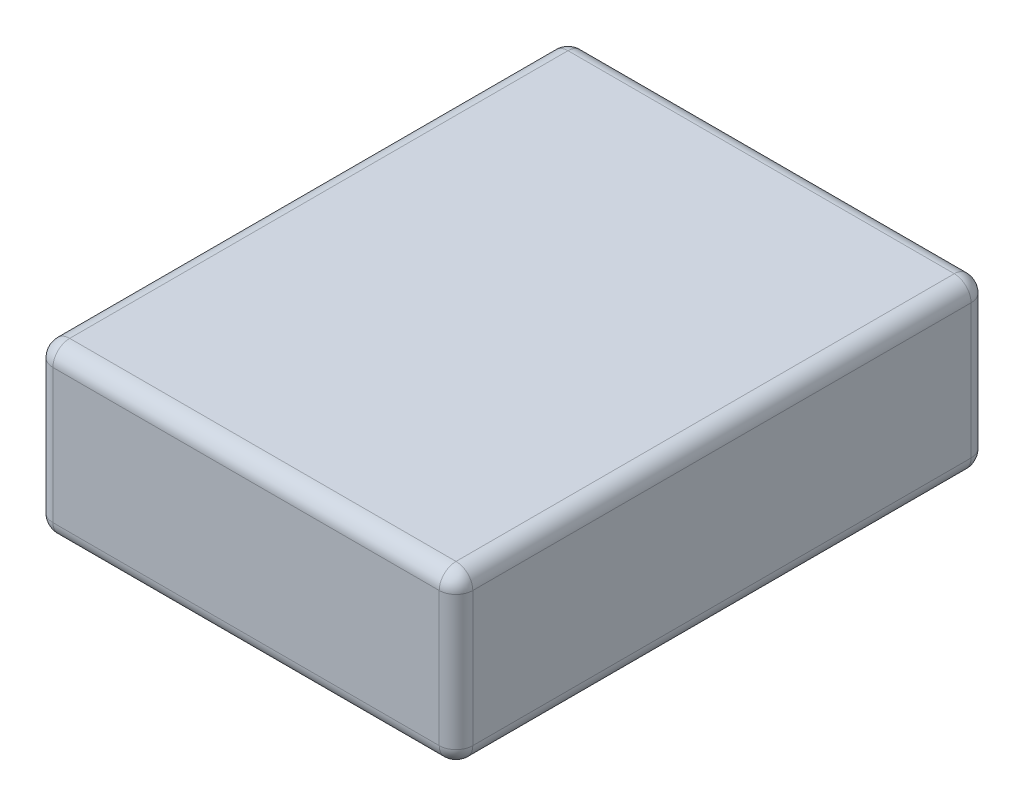
ISO-10303-21;
HEADER;
FILE_DESCRIPTION(('STEP AP214'),'2;1');
FILE_NAME('part.step','',(''),(''),'','','');
FILE_SCHEMA(('AUTOMOTIVE_DESIGN { 1 0 10303 214 1 1 1 1 }'));
ENDSEC;
DATA;
#1=APPLICATION_CONTEXT('core data for automotive mechanical design processes');
#2=APPLICATION_PROTOCOL_DEFINITION('international standard','automotive_design',2000,#1);
#3=PRODUCT_CONTEXT('',#1,'mechanical');
#4=PRODUCT('Part','Part','',(#3));
#5=PRODUCT_RELATED_PRODUCT_CATEGORY('part','',(#4));
#6=PRODUCT_DEFINITION_FORMATION('','',#4);
#7=PRODUCT_DEFINITION_CONTEXT('part definition',#1,'design');
#8=PRODUCT_DEFINITION('design','',#6,#7);
#9=PRODUCT_DEFINITION_SHAPE('','',#8);
#10=(LENGTH_UNIT() NAMED_UNIT(*) SI_UNIT(.MILLI.,.METRE.));
#11=(NAMED_UNIT(*) PLANE_ANGLE_UNIT() SI_UNIT($,.RADIAN.));
#12=(NAMED_UNIT(*) SI_UNIT($,.STERADIAN.) SOLID_ANGLE_UNIT());
#13=UNCERTAINTY_MEASURE_WITH_UNIT(LENGTH_MEASURE(1.E-05),#10,'distance_accuracy_value','');
#14=(GEOMETRIC_REPRESENTATION_CONTEXT(3) GLOBAL_UNCERTAINTY_ASSIGNED_CONTEXT((#13)) GLOBAL_UNIT_ASSIGNED_CONTEXT((#10,
#11,#12)) REPRESENTATION_CONTEXT('',''));
#15=CARTESIAN_POINT('',(0.,0.,0.));
#16=DIRECTION('',(0.,0.,1.));
#17=DIRECTION('',(1.,0.,0.));
#18=AXIS2_PLACEMENT_3D('',#15,#16,#17);
#19=CARTESIAN_POINT('',(3.75,-1.5,9.5));
#20=DIRECTION('',(-1.,0.,0.));
#21=DIRECTION('',(0.,0.,1.));
#22=AXIS2_PLACEMENT_3D('',#19,#20,#21);
#23=PLANE('',#22);
#24=DIRECTION('',(0.,1.,0.));
#25=VECTOR('',#24,1.);
#26=CARTESIAN_POINT('',(3.75,-1.5,9.2));
#27=LINE('',#26,#25);
#28=CARTESIAN_POINT('',(3.75,1.2,9.2));
#29=VERTEX_POINT('',#28);
#30=CARTESIAN_POINT('',(3.75,-1.2,9.2));
#31=VERTEX_POINT('',#30);
#32=EDGE_CURVE('E193',#29,#31,#27,.F.);
#33=ORIENTED_EDGE('',*,*,#32,.T.);
#34=DIRECTION('',(0.,0.,-1.));
#35=VECTOR('',#34,1.);
#36=CARTESIAN_POINT('',(3.75,-1.2,9.5));
#37=LINE('',#36,#35);
#38=CARTESIAN_POINT('',(3.75,-1.2,0.3));
#39=VERTEX_POINT('',#38);
#40=EDGE_CURVE('E147',#31,#39,#37,.T.);
#41=ORIENTED_EDGE('',*,*,#40,.T.);
#42=DIRECTION('',(0.,1.,0.));
#43=VECTOR('',#42,1.);
#44=CARTESIAN_POINT('',(3.75,1.5,0.3));
#45=LINE('',#44,#43);
#46=CARTESIAN_POINT('',(3.75,1.2,0.3));
#47=VERTEX_POINT('',#46);
#48=EDGE_CURVE('E195',#39,#47,#45,.T.);
#49=ORIENTED_EDGE('',*,*,#48,.T.);
#50=DIRECTION('',(0.,0.,-1.));
#51=VECTOR('',#50,1.);
#52=CARTESIAN_POINT('',(3.75,1.2,9.5));
#53=LINE('',#52,#51);
#54=EDGE_CURVE('E191',#47,#29,#53,.F.);
#55=ORIENTED_EDGE('',*,*,#54,.T.);
#56=EDGE_LOOP('',(#33,#41,#49,#55));
#57=FACE_BOUND('',#56,.T.);
#58=ADVANCED_FACE('F41',(#57),#23,.F.);
#59=CARTESIAN_POINT('',(-3.75,1.5,9.5));
#60=DIRECTION('',(0.,-1.,0.));
#61=DIRECTION('',(0.,0.,-1.));
#62=AXIS2_PLACEMENT_3D('',#59,#60,#61);
#63=PLANE('',#62);
#64=DIRECTION('',(-1.,0.,0.));
#65=VECTOR('',#64,1.);
#66=CARTESIAN_POINT('',(-3.75,1.5,9.2));
#67=LINE('',#66,#65);
#68=CARTESIAN_POINT('',(-3.45,1.5,9.2));
#69=VERTEX_POINT('',#68);
#70=CARTESIAN_POINT('',(3.45,1.5,9.2));
#71=VERTEX_POINT('',#70);
#72=EDGE_CURVE('E50',#69,#71,#67,.F.);
#73=ORIENTED_EDGE('',*,*,#72,.T.);
#74=DIRECTION('',(0.,0.,-1.));
#75=VECTOR('',#74,1.);
#76=CARTESIAN_POINT('',(3.45,1.5,9.5));
#77=LINE('',#76,#75);
#78=CARTESIAN_POINT('',(3.45,1.5,0.3));
#79=VERTEX_POINT('',#78);
#80=EDGE_CURVE('E11',#71,#79,#77,.T.);
#81=ORIENTED_EDGE('',*,*,#80,.T.);
#82=DIRECTION('',(-1.,0.,0.));
#83=VECTOR('',#82,1.);
#84=CARTESIAN_POINT('',(-3.75,1.5,0.3));
#85=LINE('',#84,#83);
#86=CARTESIAN_POINT('',(-3.45,1.5,0.3));
#87=VERTEX_POINT('',#86);
#88=EDGE_CURVE('E207',#79,#87,#85,.T.);
#89=ORIENTED_EDGE('',*,*,#88,.T.);
#90=DIRECTION('',(0.,0.,-1.));
#91=VECTOR('',#90,1.);
#92=CARTESIAN_POINT('',(-3.45,1.5,9.5));
#93=LINE('',#92,#91);
#94=EDGE_CURVE('E61',#87,#69,#93,.F.);
#95=ORIENTED_EDGE('',*,*,#94,.T.);
#96=EDGE_LOOP('',(#73,#81,#89,#95));
#97=FACE_BOUND('',#96,.T.);
#98=ADVANCED_FACE('F280',(#97),#63,.F.);
#99=CARTESIAN_POINT('',(-3.75,-1.5,9.5));
#100=DIRECTION('',(1.,0.,0.));
#101=DIRECTION('',(0.,0.,-1.));
#102=AXIS2_PLACEMENT_3D('',#99,#100,#101);
#103=PLANE('',#102);
#104=DIRECTION('',(0.,-1.,0.));
#105=VECTOR('',#104,1.);
#106=CARTESIAN_POINT('',(-3.75,-1.5,0.3));
#107=LINE('',#106,#105);
#108=CARTESIAN_POINT('',(-3.75,1.2,0.3));
#109=VERTEX_POINT('',#108);
#110=CARTESIAN_POINT('',(-3.75,-1.2,0.3));
#111=VERTEX_POINT('',#110);
#112=EDGE_CURVE('E177',#109,#111,#107,.T.);
#113=ORIENTED_EDGE('',*,*,#112,.T.);
#114=DIRECTION('',(0.,0.,-1.));
#115=VECTOR('',#114,1.);
#116=CARTESIAN_POINT('',(-3.75,-1.2,9.5));
#117=LINE('',#116,#115);
#118=CARTESIAN_POINT('',(-3.75,-1.2,9.2));
#119=VERTEX_POINT('',#118);
#120=EDGE_CURVE('E179',#111,#119,#117,.F.);
#121=ORIENTED_EDGE('',*,*,#120,.T.);
#122=DIRECTION('',(0.,-1.,0.));
#123=VECTOR('',#122,1.);
#124=CARTESIAN_POINT('',(-3.75,-1.5,9.2));
#125=LINE('',#124,#123);
#126=CARTESIAN_POINT('',(-3.75,1.2,9.2));
#127=VERTEX_POINT('',#126);
#128=EDGE_CURVE('E175',#119,#127,#125,.F.);
#129=ORIENTED_EDGE('',*,*,#128,.T.);
#130=DIRECTION('',(0.,0.,-1.));
#131=VECTOR('',#130,1.);
#132=CARTESIAN_POINT('',(-3.75,1.2,9.5));
#133=LINE('',#132,#131);
#134=EDGE_CURVE('E173',#127,#109,#133,.T.);
#135=ORIENTED_EDGE('',*,*,#134,.T.);
#136=EDGE_LOOP('',(#113,#121,#129,#135));
#137=FACE_BOUND('',#136,.T.);
#138=ADVANCED_FACE('F340',(#137),#103,.F.);
#139=CARTESIAN_POINT('',(-3.75,-1.5,9.5));
#140=DIRECTION('',(0.,1.,0.));
#141=DIRECTION('',(0.,0.,1.));
#142=AXIS2_PLACEMENT_3D('',#139,#140,#141);
#143=PLANE('',#142);
#144=DIRECTION('',(1.,0.,0.));
#145=VECTOR('',#144,1.);
#146=CARTESIAN_POINT('',(-3.75,-1.5,9.2));
#147=LINE('',#146,#145);
#148=CARTESIAN_POINT('',(3.45,-1.5,9.2));
#149=VERTEX_POINT('',#148);
#150=CARTESIAN_POINT('',(-3.45,-1.5,9.2));
#151=VERTEX_POINT('',#150);
#152=EDGE_CURVE('E133',#149,#151,#147,.F.);
#153=ORIENTED_EDGE('',*,*,#152,.T.);
#154=DIRECTION('',(0.,0.,-1.));
#155=VECTOR('',#154,1.);
#156=CARTESIAN_POINT('',(-3.45,-1.5,9.5));
#157=LINE('',#156,#155);
#158=CARTESIAN_POINT('',(-3.45,-1.5,0.3));
#159=VERTEX_POINT('',#158);
#160=EDGE_CURVE('E171',#151,#159,#157,.T.);
#161=ORIENTED_EDGE('',*,*,#160,.T.);
#162=DIRECTION('',(1.,0.,0.));
#163=VECTOR('',#162,1.);
#164=CARTESIAN_POINT('',(3.75,-1.5,0.3));
#165=LINE('',#164,#163);
#166=CARTESIAN_POINT('',(3.45,-1.5,0.3));
#167=VERTEX_POINT('',#166);
#168=EDGE_CURVE('E136',#159,#167,#165,.T.);
#169=ORIENTED_EDGE('',*,*,#168,.T.);
#170=DIRECTION('',(0.,0.,-1.));
#171=VECTOR('',#170,1.);
#172=CARTESIAN_POINT('',(3.45,-1.5,9.5));
#173=LINE('',#172,#171);
#174=EDGE_CURVE('E128',#167,#149,#173,.F.);
#175=ORIENTED_EDGE('',*,*,#174,.T.);
#176=EDGE_LOOP('',(#153,#161,#169,#175));
#177=FACE_BOUND('',#176,.T.);
#178=ADVANCED_FACE('F130',(#177),#143,.F.);
#179=CARTESIAN_POINT('',(0.,0.,9.5));
#180=DIRECTION('',(0.,0.,-1.));
#181=DIRECTION('',(-1.,0.,0.));
#182=AXIS2_PLACEMENT_3D('',#179,#180,#181);
#183=PLANE('',#182);
#184=DIRECTION('',(0.,-1.,0.));
#185=VECTOR('',#184,1.);
#186=CARTESIAN_POINT('',(-3.45,0.,9.5));
#187=LINE('',#186,#185);
#188=CARTESIAN_POINT('',(-3.45,1.2,9.5));
#189=VERTEX_POINT('',#188);
#190=CARTESIAN_POINT('',(-3.45,-1.2,9.5));
#191=VERTEX_POINT('',#190);
#192=EDGE_CURVE('E202',#189,#191,#187,.T.);
#193=ORIENTED_EDGE('',*,*,#192,.T.);
#194=DIRECTION('',(1.,0.,0.));
#195=VECTOR('',#194,1.);
#196=CARTESIAN_POINT('',(0.,-1.2,9.5));
#197=LINE('',#196,#195);
#198=CARTESIAN_POINT('',(3.45,-1.2,9.5));
#199=VERTEX_POINT('',#198);
#200=EDGE_CURVE('E204',#191,#199,#197,.T.);
#201=ORIENTED_EDGE('',*,*,#200,.T.);
#202=DIRECTION('',(0.,1.,0.));
#203=VECTOR('',#202,1.);
#204=CARTESIAN_POINT('',(3.45,0.,9.5));
#205=LINE('',#204,#203);
#206=CARTESIAN_POINT('',(3.45,1.2,9.5));
#207=VERTEX_POINT('',#206);
#208=EDGE_CURVE('E200',#199,#207,#205,.T.);
#209=ORIENTED_EDGE('',*,*,#208,.T.);
#210=DIRECTION('',(-1.,0.,0.));
#211=VECTOR('',#210,1.);
#212=CARTESIAN_POINT('',(0.,1.2,9.5));
#213=LINE('',#212,#211);
#214=EDGE_CURVE('E198',#207,#189,#213,.T.);
#215=ORIENTED_EDGE('',*,*,#214,.T.);
#216=EDGE_LOOP('',(#193,#201,#209,#215));
#217=FACE_BOUND('',#216,.T.);
#218=ADVANCED_FACE('F305',(#217),#183,.F.);
#219=CARTESIAN_POINT('',(0.,0.,0.));
#220=DIRECTION('',(0.,0.,-1.));
#221=DIRECTION('',(-1.,0.,0.));
#222=AXIS2_PLACEMENT_3D('',#219,#220,#221);
#223=PLANE('',#222);
#224=DIRECTION('',(1.,0.,0.));
#225=VECTOR('',#224,1.);
#226=CARTESIAN_POINT('',(-3.75,-1.2,0.));
#227=LINE('',#226,#225);
#228=CARTESIAN_POINT('',(3.45,-1.2,0.));
#229=VERTEX_POINT('',#228);
#230=CARTESIAN_POINT('',(-3.45,-1.2,0.));
#231=VERTEX_POINT('',#230);
#232=EDGE_CURVE('E186',#229,#231,#227,.F.);
#233=ORIENTED_EDGE('',*,*,#232,.T.);
#234=DIRECTION('',(0.,-1.,0.));
#235=VECTOR('',#234,1.);
#236=CARTESIAN_POINT('',(-3.45,1.5,0.));
#237=LINE('',#236,#235);
#238=CARTESIAN_POINT('',(-3.45,1.2,0.));
#239=VERTEX_POINT('',#238);
#240=EDGE_CURVE('E188',#231,#239,#237,.F.);
#241=ORIENTED_EDGE('',*,*,#240,.T.);
#242=DIRECTION('',(-1.,0.,0.));
#243=VECTOR('',#242,1.);
#244=CARTESIAN_POINT('',(3.75,1.2,0.));
#245=LINE('',#244,#243);
#246=CARTESIAN_POINT('',(3.45,1.2,0.));
#247=VERTEX_POINT('',#246);
#248=EDGE_CURVE('E182',#239,#247,#245,.F.);
#249=ORIENTED_EDGE('',*,*,#248,.T.);
#250=DIRECTION('',(0.,1.,0.));
#251=VECTOR('',#250,1.);
#252=CARTESIAN_POINT('',(3.45,-1.5,0.));
#253=LINE('',#252,#251);
#254=EDGE_CURVE('E184',#247,#229,#253,.F.);
#255=ORIENTED_EDGE('',*,*,#254,.T.);
#256=EDGE_LOOP('',(#233,#241,#249,#255));
#257=FACE_BOUND('',#256,.T.);
#258=ADVANCED_FACE('F273',(#257),#223,.T.);
#259=CARTESIAN_POINT('',(3.45,1.2,9.5));
#260=DIRECTION('',(0.,0.,-1.));
#261=DIRECTION('',(-1.,0.,0.));
#262=AXIS2_PLACEMENT_3D('',#259,#260,#261);
#263=CYLINDRICAL_SURFACE('',#262,0.3);
#264=CARTESIAN_POINT('',(3.45,1.2,9.2));
#265=DIRECTION('',(0.,0.,1.));
#266=DIRECTION('',(1.,0.,0.));
#267=AXIS2_PLACEMENT_3D('',#264,#265,#266);
#268=CIRCLE('',#267,0.3);
#269=EDGE_CURVE('E45',#29,#71,#268,.T.);
#270=ORIENTED_EDGE('',*,*,#269,.F.);
#271=ORIENTED_EDGE('',*,*,#54,.F.);
#272=CARTESIAN_POINT('',(3.45,1.2,0.3));
#273=DIRECTION('',(0.,0.,-1.));
#274=DIRECTION('',(-1.,0.,0.));
#275=AXIS2_PLACEMENT_3D('',#272,#273,#274);
#276=CIRCLE('',#275,0.3);
#277=EDGE_CURVE('E168',#79,#47,#276,.T.);
#278=ORIENTED_EDGE('',*,*,#277,.F.);
#279=ORIENTED_EDGE('',*,*,#80,.F.);
#280=EDGE_LOOP('',(#270,#271,#278,#279));
#281=FACE_BOUND('',#280,.T.);
#282=ADVANCED_FACE('F43',(#281),#263,.T.);
#283=CARTESIAN_POINT('',(3.45,1.2,9.2));
#284=DIRECTION('',(0.,1.,0.));
#285=DIRECTION('',(0.,0.,1.));
#286=AXIS2_PLACEMENT_3D('',#283,#284,#285);
#287=SPHERICAL_SURFACE('',#286,0.3);
#288=CARTESIAN_POINT('',(3.45,1.2,9.2));
#289=DIRECTION('',(0.,1.,0.));
#290=DIRECTION('',(0.,0.,1.));
#291=AXIS2_PLACEMENT_3D('',#288,#289,#290);
#292=CIRCLE('',#291,0.3);
#293=EDGE_CURVE('E253',#29,#207,#292,.F.);
#294=ORIENTED_EDGE('',*,*,#293,.F.);
#295=ORIENTED_EDGE('',*,*,#269,.T.);
#296=CARTESIAN_POINT('',(3.45,1.2,9.2));
#297=DIRECTION('',(1.,0.,0.));
#298=DIRECTION('',(0.,0.,-1.));
#299=AXIS2_PLACEMENT_3D('',#296,#297,#298);
#300=CIRCLE('',#299,0.3);
#301=EDGE_CURVE('E256',#207,#71,#300,.F.);
#302=ORIENTED_EDGE('',*,*,#301,.F.);
#303=EDGE_LOOP('',(#294,#295,#302));
#304=FACE_BOUND('',#303,.T.);
#305=ADVANCED_FACE('F298',(#304),#287,.T.);
#306=CARTESIAN_POINT('',(3.45,1.2,0.3));
#307=DIRECTION('',(1.,0.,0.));
#308=DIRECTION('',(0.,0.,-1.));
#309=AXIS2_PLACEMENT_3D('',#306,#307,#308);
#310=SPHERICAL_SURFACE('',#309,0.3);
#311=CARTESIAN_POINT('',(3.45,1.2,0.3));
#312=DIRECTION('',(1.,0.,0.));
#313=DIRECTION('',(0.,0.,-1.));
#314=AXIS2_PLACEMENT_3D('',#311,#312,#313);
#315=CIRCLE('',#314,0.3);
#316=EDGE_CURVE('E247',#79,#247,#315,.F.);
#317=ORIENTED_EDGE('',*,*,#316,.F.);
#318=ORIENTED_EDGE('',*,*,#277,.T.);
#319=CARTESIAN_POINT('',(3.45,1.2,0.3));
#320=DIRECTION('',(0.,1.,0.));
#321=DIRECTION('',(0.,0.,1.));
#322=AXIS2_PLACEMENT_3D('',#319,#320,#321);
#323=CIRCLE('',#322,0.3);
#324=EDGE_CURVE('E250',#247,#47,#323,.F.);
#325=ORIENTED_EDGE('',*,*,#324,.F.);
#326=EDGE_LOOP('',(#317,#318,#325));
#327=FACE_BOUND('',#326,.T.);
#328=ADVANCED_FACE('F263',(#327),#310,.T.);
#329=CARTESIAN_POINT('',(0.,1.2,9.2));
#330=DIRECTION('',(-1.,0.,0.));
#331=DIRECTION('',(0.,0.,1.));
#332=AXIS2_PLACEMENT_3D('',#329,#330,#331);
#333=CYLINDRICAL_SURFACE('',#332,0.3);
#334=ORIENTED_EDGE('',*,*,#301,.T.);
#335=ORIENTED_EDGE('',*,*,#72,.F.);
#336=CARTESIAN_POINT('',(-3.45,1.2,9.2));
#337=DIRECTION('',(-1.,0.,0.));
#338=DIRECTION('',(0.,0.,1.));
#339=AXIS2_PLACEMENT_3D('',#336,#337,#338);
#340=CIRCLE('',#339,0.3);
#341=EDGE_CURVE('E241',#189,#69,#340,.T.);
#342=ORIENTED_EDGE('',*,*,#341,.F.);
#343=ORIENTED_EDGE('',*,*,#214,.F.);
#344=EDGE_LOOP('',(#334,#335,#342,#343));
#345=FACE_BOUND('',#344,.T.);
#346=ADVANCED_FACE('F294',(#345),#333,.T.);
#347=CARTESIAN_POINT('',(3.45,0.,9.2));
#348=DIRECTION('',(0.,1.,0.));
#349=DIRECTION('',(0.,0.,1.));
#350=AXIS2_PLACEMENT_3D('',#347,#348,#349);
#351=CYLINDRICAL_SURFACE('',#350,0.3);
#352=ORIENTED_EDGE('',*,*,#293,.T.);
#353=ORIENTED_EDGE('',*,*,#208,.F.);
#354=CARTESIAN_POINT('',(3.45,-1.2,9.2));
#355=DIRECTION('',(0.,-1.,0.));
#356=DIRECTION('',(0.,0.,-1.));
#357=AXIS2_PLACEMENT_3D('',#354,#355,#356);
#358=CIRCLE('',#357,0.3);
#359=EDGE_CURVE('E151',#31,#199,#358,.T.);
#360=ORIENTED_EDGE('',*,*,#359,.F.);
#361=ORIENTED_EDGE('',*,*,#32,.F.);
#362=EDGE_LOOP('',(#352,#353,#360,#361));
#363=FACE_BOUND('',#362,.T.);
#364=ADVANCED_FACE('F303',(#363),#351,.T.);
#365=CARTESIAN_POINT('',(3.45,-1.2,9.5));
#366=DIRECTION('',(0.,0.,-1.));
#367=DIRECTION('',(-1.,0.,0.));
#368=AXIS2_PLACEMENT_3D('',#365,#366,#367);
#369=CYLINDRICAL_SURFACE('',#368,0.3);
#370=CARTESIAN_POINT('',(3.45,-1.2,0.3));
#371=DIRECTION('',(0.,0.,-1.));
#372=DIRECTION('',(-1.,0.,0.));
#373=AXIS2_PLACEMENT_3D('',#370,#371,#372);
#374=CIRCLE('',#373,0.3);
#375=EDGE_CURVE('E152',#39,#167,#374,.T.);
#376=ORIENTED_EDGE('',*,*,#375,.F.);
#377=ORIENTED_EDGE('',*,*,#40,.F.);
#378=CARTESIAN_POINT('',(3.45,-1.2,9.2));
#379=DIRECTION('',(0.,0.,1.));
#380=DIRECTION('',(1.,0.,0.));
#381=AXIS2_PLACEMENT_3D('',#378,#379,#380);
#382=CIRCLE('',#381,0.3);
#383=EDGE_CURVE('E143',#149,#31,#382,.T.);
#384=ORIENTED_EDGE('',*,*,#383,.F.);
#385=ORIENTED_EDGE('',*,*,#174,.F.);
#386=EDGE_LOOP('',(#376,#377,#384,#385));
#387=FACE_BOUND('',#386,.T.);
#388=ADVANCED_FACE('F145',(#387),#369,.T.);
#389=CARTESIAN_POINT('',(3.45,-1.5,0.3));
#390=DIRECTION('',(0.,-1.,0.));
#391=DIRECTION('',(0.,0.,-1.));
#392=AXIS2_PLACEMENT_3D('',#389,#390,#391);
#393=CYLINDRICAL_SURFACE('',#392,0.3);
#394=ORIENTED_EDGE('',*,*,#324,.T.);
#395=ORIENTED_EDGE('',*,*,#48,.F.);
#396=CARTESIAN_POINT('',(3.45,-1.2,0.3));
#397=DIRECTION('',(0.,-1.,0.));
#398=DIRECTION('',(0.,0.,-1.));
#399=AXIS2_PLACEMENT_3D('',#396,#397,#398);
#400=CIRCLE('',#399,0.3);
#401=EDGE_CURVE('E237',#229,#39,#400,.T.);
#402=ORIENTED_EDGE('',*,*,#401,.F.);
#403=ORIENTED_EDGE('',*,*,#254,.F.);
#404=EDGE_LOOP('',(#394,#395,#402,#403));
#405=FACE_BOUND('',#404,.T.);
#406=ADVANCED_FACE('F269',(#405),#393,.T.);
#407=CARTESIAN_POINT('',(-3.75,1.2,0.3));
#408=DIRECTION('',(1.,0.,0.));
#409=DIRECTION('',(0.,0.,-1.));
#410=AXIS2_PLACEMENT_3D('',#407,#408,#409);
#411=CYLINDRICAL_SURFACE('',#410,0.3);
#412=ORIENTED_EDGE('',*,*,#316,.T.);
#413=ORIENTED_EDGE('',*,*,#248,.F.);
#414=CARTESIAN_POINT('',(-3.45,1.2,0.3));
#415=DIRECTION('',(-1.,0.,0.));
#416=DIRECTION('',(0.,0.,1.));
#417=AXIS2_PLACEMENT_3D('',#414,#415,#416);
#418=CIRCLE('',#417,0.3);
#419=EDGE_CURVE('E234',#87,#239,#418,.T.);
#420=ORIENTED_EDGE('',*,*,#419,.F.);
#421=ORIENTED_EDGE('',*,*,#88,.F.);
#422=EDGE_LOOP('',(#412,#413,#420,#421));
#423=FACE_BOUND('',#422,.T.);
#424=ADVANCED_FACE('F279',(#423),#411,.T.);
#425=CARTESIAN_POINT('',(-3.45,1.2,9.5));
#426=DIRECTION('',(0.,0.,-1.));
#427=DIRECTION('',(-1.,0.,0.));
#428=AXIS2_PLACEMENT_3D('',#425,#426,#427);
#429=CYLINDRICAL_SURFACE('',#428,0.3);
#430=CARTESIAN_POINT('',(-3.45,1.2,9.2));
#431=DIRECTION('',(0.,0.,1.));
#432=DIRECTION('',(1.,0.,0.));
#433=AXIS2_PLACEMENT_3D('',#430,#431,#432);
#434=CIRCLE('',#433,0.3);
#435=EDGE_CURVE('E244',#69,#127,#434,.T.);
#436=ORIENTED_EDGE('',*,*,#435,.F.);
#437=ORIENTED_EDGE('',*,*,#94,.F.);
#438=CARTESIAN_POINT('',(-3.45,1.2,0.3));
#439=DIRECTION('',(0.,0.,-1.));
#440=DIRECTION('',(-1.,0.,0.));
#441=AXIS2_PLACEMENT_3D('',#438,#439,#440);
#442=CIRCLE('',#441,0.3);
#443=EDGE_CURVE('E231',#109,#87,#442,.T.);
#444=ORIENTED_EDGE('',*,*,#443,.F.);
#445=ORIENTED_EDGE('',*,*,#134,.F.);
#446=EDGE_LOOP('',(#436,#437,#444,#445));
#447=FACE_BOUND('',#446,.T.);
#448=ADVANCED_FACE('F284',(#447),#429,.T.);
#449=CARTESIAN_POINT('',(-3.45,1.2,9.2));
#450=DIRECTION('',(0.,1.,0.));
#451=DIRECTION('',(0.,0.,1.));
#452=AXIS2_PLACEMENT_3D('',#449,#450,#451);
#453=SPHERICAL_SURFACE('',#452,0.3);
#454=ORIENTED_EDGE('',*,*,#341,.T.);
#455=ORIENTED_EDGE('',*,*,#435,.T.);
#456=CARTESIAN_POINT('',(-3.45,1.2,9.2));
#457=DIRECTION('',(0.,1.,0.));
#458=DIRECTION('',(0.,0.,1.));
#459=AXIS2_PLACEMENT_3D('',#456,#457,#458);
#460=CIRCLE('',#459,0.3);
#461=EDGE_CURVE('E159',#189,#127,#460,.F.);
#462=ORIENTED_EDGE('',*,*,#461,.F.);
#463=EDGE_LOOP('',(#454,#455,#462));
#464=FACE_BOUND('',#463,.T.);
#465=ADVANCED_FACE('F290',(#464),#453,.T.);
#466=CARTESIAN_POINT('',(3.45,-1.2,9.2));
#467=DIRECTION('',(1.,0.,0.));
#468=DIRECTION('',(0.,0.,-1.));
#469=AXIS2_PLACEMENT_3D('',#466,#467,#468);
#470=SPHERICAL_SURFACE('',#469,0.3);
#471=ORIENTED_EDGE('',*,*,#383,.T.);
#472=ORIENTED_EDGE('',*,*,#359,.T.);
#473=CARTESIAN_POINT('',(3.45,-1.2,9.2));
#474=DIRECTION('',(1.,0.,0.));
#475=DIRECTION('',(0.,0.,-1.));
#476=AXIS2_PLACEMENT_3D('',#473,#474,#475);
#477=CIRCLE('',#476,0.3);
#478=EDGE_CURVE('E154',#149,#199,#477,.F.);
#479=ORIENTED_EDGE('',*,*,#478,.F.);
#480=EDGE_LOOP('',(#471,#472,#479));
#481=FACE_BOUND('',#480,.T.);
#482=ADVANCED_FACE('F155',(#481),#470,.T.);
#483=CARTESIAN_POINT('',(3.45,-1.2,0.3));
#484=DIRECTION('',(1.,0.,0.));
#485=DIRECTION('',(0.,0.,-1.));
#486=AXIS2_PLACEMENT_3D('',#483,#484,#485);
#487=SPHERICAL_SURFACE('',#486,0.3);
#488=ORIENTED_EDGE('',*,*,#401,.T.);
#489=ORIENTED_EDGE('',*,*,#375,.T.);
#490=CARTESIAN_POINT('',(3.45,-1.2,0.3));
#491=DIRECTION('',(1.,0.,0.));
#492=DIRECTION('',(0.,0.,-1.));
#493=AXIS2_PLACEMENT_3D('',#490,#491,#492);
#494=CIRCLE('',#493,0.3);
#495=EDGE_CURVE('E160',#229,#167,#494,.F.);
#496=ORIENTED_EDGE('',*,*,#495,.F.);
#497=EDGE_LOOP('',(#488,#489,#496));
#498=FACE_BOUND('',#497,.T.);
#499=ADVANCED_FACE('F324',(#498),#487,.T.);
#500=CARTESIAN_POINT('',(-3.45,1.2,0.3));
#501=DIRECTION('',(0.,1.,0.));
#502=DIRECTION('',(0.,0.,1.));
#503=AXIS2_PLACEMENT_3D('',#500,#501,#502);
#504=SPHERICAL_SURFACE('',#503,0.3);
#505=ORIENTED_EDGE('',*,*,#443,.T.);
#506=ORIENTED_EDGE('',*,*,#419,.T.);
#507=CARTESIAN_POINT('',(-3.45,1.2,0.3));
#508=DIRECTION('',(0.,1.,0.));
#509=DIRECTION('',(0.,0.,1.));
#510=AXIS2_PLACEMENT_3D('',#507,#508,#509);
#511=CIRCLE('',#510,0.3);
#512=EDGE_CURVE('E225',#109,#239,#511,.F.);
#513=ORIENTED_EDGE('',*,*,#512,.F.);
#514=EDGE_LOOP('',(#505,#506,#513));
#515=FACE_BOUND('',#514,.T.);
#516=ADVANCED_FACE('F326',(#515),#504,.T.);
#517=CARTESIAN_POINT('',(-3.45,0.,9.2));
#518=DIRECTION('',(0.,-1.,0.));
#519=DIRECTION('',(0.,0.,-1.));
#520=AXIS2_PLACEMENT_3D('',#517,#518,#519);
#521=CYLINDRICAL_SURFACE('',#520,0.3);
#522=ORIENTED_EDGE('',*,*,#461,.T.);
#523=ORIENTED_EDGE('',*,*,#128,.F.);
#524=CARTESIAN_POINT('',(-3.45,-1.2,9.2));
#525=DIRECTION('',(0.,-1.,0.));
#526=DIRECTION('',(0.,0.,-1.));
#527=AXIS2_PLACEMENT_3D('',#524,#525,#526);
#528=CIRCLE('',#527,0.3);
#529=EDGE_CURVE('E222',#191,#119,#528,.T.);
#530=ORIENTED_EDGE('',*,*,#529,.F.);
#531=ORIENTED_EDGE('',*,*,#192,.F.);
#532=EDGE_LOOP('',(#522,#523,#530,#531));
#533=FACE_BOUND('',#532,.T.);
#534=ADVANCED_FACE('F309',(#533),#521,.T.);
#535=CARTESIAN_POINT('',(0.,-1.2,9.2));
#536=DIRECTION('',(1.,0.,0.));
#537=DIRECTION('',(0.,0.,-1.));
#538=AXIS2_PLACEMENT_3D('',#535,#536,#537);
#539=CYLINDRICAL_SURFACE('',#538,0.3);
#540=ORIENTED_EDGE('',*,*,#478,.T.);
#541=ORIENTED_EDGE('',*,*,#200,.F.);
#542=CARTESIAN_POINT('',(-3.45,-1.2,9.2));
#543=DIRECTION('',(-1.,0.,0.));
#544=DIRECTION('',(0.,0.,1.));
#545=AXIS2_PLACEMENT_3D('',#542,#543,#544);
#546=CIRCLE('',#545,0.3);
#547=EDGE_CURVE('E164',#151,#191,#546,.T.);
#548=ORIENTED_EDGE('',*,*,#547,.F.);
#549=ORIENTED_EDGE('',*,*,#152,.F.);
#550=EDGE_LOOP('',(#540,#541,#548,#549));
#551=FACE_BOUND('',#550,.T.);
#552=ADVANCED_FACE('F162',(#551),#539,.T.);
#553=CARTESIAN_POINT('',(-3.75,-1.2,0.3));
#554=DIRECTION('',(-1.,0.,0.));
#555=DIRECTION('',(0.,0.,1.));
#556=AXIS2_PLACEMENT_3D('',#553,#554,#555);
#557=CYLINDRICAL_SURFACE('',#556,0.3);
#558=ORIENTED_EDGE('',*,*,#495,.T.);
#559=ORIENTED_EDGE('',*,*,#168,.F.);
#560=CARTESIAN_POINT('',(-3.45,-1.2,0.3));
#561=DIRECTION('',(-1.,0.,0.));
#562=DIRECTION('',(0.,0.,1.));
#563=AXIS2_PLACEMENT_3D('',#560,#561,#562);
#564=CIRCLE('',#563,0.3);
#565=EDGE_CURVE('E218',#231,#159,#564,.T.);
#566=ORIENTED_EDGE('',*,*,#565,.F.);
#567=ORIENTED_EDGE('',*,*,#232,.F.);
#568=EDGE_LOOP('',(#558,#559,#566,#567));
#569=FACE_BOUND('',#568,.T.);
#570=ADVANCED_FACE('F322',(#569),#557,.T.);
#571=CARTESIAN_POINT('',(-3.45,-1.5,0.3));
#572=DIRECTION('',(0.,1.,0.));
#573=DIRECTION('',(0.,0.,1.));
#574=AXIS2_PLACEMENT_3D('',#571,#572,#573);
#575=CYLINDRICAL_SURFACE('',#574,0.3);
#576=ORIENTED_EDGE('',*,*,#512,.T.);
#577=ORIENTED_EDGE('',*,*,#240,.F.);
#578=CARTESIAN_POINT('',(-3.45,-1.2,0.3));
#579=DIRECTION('',(0.,-1.,0.));
#580=DIRECTION('',(0.,0.,-1.));
#581=AXIS2_PLACEMENT_3D('',#578,#579,#580);
#582=CIRCLE('',#581,0.3);
#583=EDGE_CURVE('E215',#111,#231,#582,.T.);
#584=ORIENTED_EDGE('',*,*,#583,.F.);
#585=ORIENTED_EDGE('',*,*,#112,.F.);
#586=EDGE_LOOP('',(#576,#577,#584,#585));
#587=FACE_BOUND('',#586,.T.);
#588=ADVANCED_FACE('F350',(#587),#575,.T.);
#589=CARTESIAN_POINT('',(-3.45,-1.2,9.2));
#590=DIRECTION('',(0.,0.,1.));
#591=DIRECTION('',(1.,0.,0.));
#592=AXIS2_PLACEMENT_3D('',#589,#590,#591);
#593=SPHERICAL_SURFACE('',#592,0.3);
#594=ORIENTED_EDGE('',*,*,#547,.T.);
#595=ORIENTED_EDGE('',*,*,#529,.T.);
#596=CARTESIAN_POINT('',(-3.45,-1.2,9.2));
#597=DIRECTION('',(0.,0.,1.));
#598=DIRECTION('',(1.,0.,0.));
#599=AXIS2_PLACEMENT_3D('',#596,#597,#598);
#600=CIRCLE('',#599,0.3);
#601=EDGE_CURVE('E213',#151,#119,#600,.F.);
#602=ORIENTED_EDGE('',*,*,#601,.F.);
#603=EDGE_LOOP('',(#594,#595,#602));
#604=FACE_BOUND('',#603,.T.);
#605=ADVANCED_FACE('F311',(#604),#593,.T.);
#606=CARTESIAN_POINT('',(-3.45,-1.2,0.3));
#607=DIRECTION('',(0.,0.,-1.));
#608=DIRECTION('',(-1.,0.,0.));
#609=AXIS2_PLACEMENT_3D('',#606,#607,#608);
#610=SPHERICAL_SURFACE('',#609,0.3);
#611=ORIENTED_EDGE('',*,*,#583,.T.);
#612=ORIENTED_EDGE('',*,*,#565,.T.);
#613=CARTESIAN_POINT('',(-3.45,-1.2,0.3));
#614=DIRECTION('',(0.,0.,-1.));
#615=DIRECTION('',(-1.,0.,0.));
#616=AXIS2_PLACEMENT_3D('',#613,#614,#615);
#617=CIRCLE('',#616,0.3);
#618=EDGE_CURVE('E211',#111,#159,#617,.F.);
#619=ORIENTED_EDGE('',*,*,#618,.F.);
#620=EDGE_LOOP('',(#611,#612,#619));
#621=FACE_BOUND('',#620,.T.);
#622=ADVANCED_FACE('F319',(#621),#610,.T.);
#623=CARTESIAN_POINT('',(-3.45,-1.2,9.5));
#624=DIRECTION('',(0.,0.,-1.));
#625=DIRECTION('',(-1.,0.,0.));
#626=AXIS2_PLACEMENT_3D('',#623,#624,#625);
#627=CYLINDRICAL_SURFACE('',#626,0.3);
#628=ORIENTED_EDGE('',*,*,#601,.T.);
#629=ORIENTED_EDGE('',*,*,#120,.F.);
#630=ORIENTED_EDGE('',*,*,#618,.T.);
#631=ORIENTED_EDGE('',*,*,#160,.F.);
#632=EDGE_LOOP('',(#628,#629,#630,#631));
#633=FACE_BOUND('',#632,.T.);
#634=ADVANCED_FACE('F315',(#633),#627,.T.);
#635=CLOSED_SHELL('',(#58,#98,#138,#178,#218,#258,#282,#305,#328,#346,#364,#388,#406,#424,#448,
#465,#482,#499,#516,#534,#552,#570,#588,#605,#622,#634));
#636=MANIFOLD_SOLID_BREP('B2',#635);
#637=ADVANCED_BREP_SHAPE_REPRESENTATION('',(#18,#636),#14);
#638=SHAPE_DEFINITION_REPRESENTATION(#9,#637);
ENDSEC;
END-ISO-10303-21;
